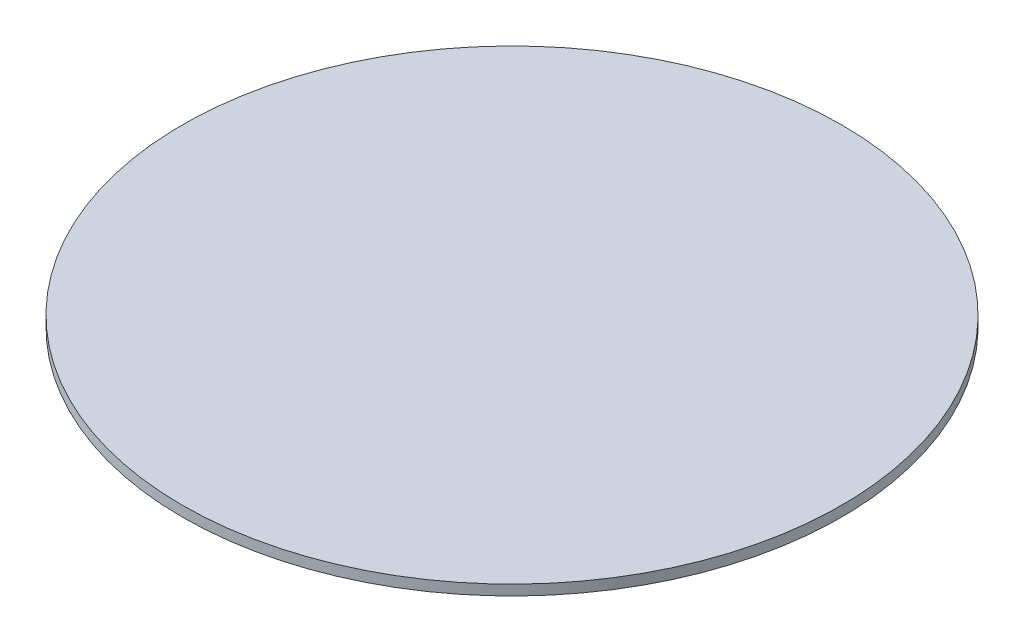
ISO-10303-21;
HEADER;
FILE_DESCRIPTION(('STEP AP214'),'2;1');
FILE_NAME('part.step','',(''),(''),'','','');
FILE_SCHEMA(('AUTOMOTIVE_DESIGN { 1 0 10303 214 1 1 1 1 }'));
ENDSEC;
DATA;
#1=APPLICATION_CONTEXT('core data for automotive mechanical design processes');
#2=APPLICATION_PROTOCOL_DEFINITION('international standard','automotive_design',2000,#1);
#3=PRODUCT_CONTEXT('',#1,'mechanical');
#4=PRODUCT('Part','Part','',(#3));
#5=PRODUCT_RELATED_PRODUCT_CATEGORY('part','',(#4));
#6=PRODUCT_DEFINITION_FORMATION('','',#4);
#7=PRODUCT_DEFINITION_CONTEXT('part definition',#1,'design');
#8=PRODUCT_DEFINITION('design','',#6,#7);
#9=PRODUCT_DEFINITION_SHAPE('','',#8);
#10=(LENGTH_UNIT() NAMED_UNIT(*) SI_UNIT(.MILLI.,.METRE.));
#11=(NAMED_UNIT(*) PLANE_ANGLE_UNIT() SI_UNIT($,.RADIAN.));
#12=(NAMED_UNIT(*) SI_UNIT($,.STERADIAN.) SOLID_ANGLE_UNIT());
#13=UNCERTAINTY_MEASURE_WITH_UNIT(LENGTH_MEASURE(1.E-05),#10,'distance_accuracy_value','');
#14=(GEOMETRIC_REPRESENTATION_CONTEXT(3) GLOBAL_UNCERTAINTY_ASSIGNED_CONTEXT((#13)) GLOBAL_UNIT_ASSIGNED_CONTEXT((#10,
#11,#12)) REPRESENTATION_CONTEXT('',''));
#15=CARTESIAN_POINT('',(0.,0.,0.));
#16=DIRECTION('',(0.,0.,1.));
#17=DIRECTION('',(1.,0.,0.));
#18=AXIS2_PLACEMENT_3D('',#15,#16,#17);
#19=CARTESIAN_POINT('',(0.,0.5,0.));
#20=DIRECTION('',(0.,-1.,0.));
#21=DIRECTION('',(0.,0.,-1.));
#22=AXIS2_PLACEMENT_3D('',#19,#20,#21);
#23=CYLINDRICAL_SURFACE('',#22,16.);
#24=CARTESIAN_POINT('',(0.,0.5,0.));
#25=DIRECTION('',(0.,1.,0.));
#26=DIRECTION('',(0.,0.,1.));
#27=AXIS2_PLACEMENT_3D('',#24,#25,#26);
#28=CIRCLE('',#27,16.);
#29=CARTESIAN_POINT('',(0.,0.5,16.));
#30=VERTEX_POINT('',#29);
#31=EDGE_CURVE('E10',#30,#30,#28,.T.);
#32=ORIENTED_EDGE('',*,*,#31,.F.);
#33=EDGE_LOOP('',(#32));
#34=FACE_BOUND('',#33,.T.);
#35=CARTESIAN_POINT('',(0.,0.,0.));
#36=DIRECTION('',(0.,1.,0.));
#37=DIRECTION('',(0.,0.,1.));
#38=AXIS2_PLACEMENT_3D('',#35,#36,#37);
#39=CIRCLE('',#38,16.);
#40=CARTESIAN_POINT('',(0.,0.,16.));
#41=VERTEX_POINT('',#40);
#42=EDGE_CURVE('E46',#41,#41,#39,.T.);
#43=ORIENTED_EDGE('',*,*,#42,.T.);
#44=EDGE_LOOP('',(#43));
#45=FACE_BOUND('',#44,.T.);
#46=ADVANCED_FACE('F43',(#34,#45),#23,.T.);
#47=CARTESIAN_POINT('',(0.,0.5,0.));
#48=DIRECTION('',(0.,1.,0.));
#49=DIRECTION('',(0.,0.,1.));
#50=AXIS2_PLACEMENT_3D('',#47,#48,#49);
#51=PLANE('',#50);
#52=ORIENTED_EDGE('',*,*,#31,.T.);
#53=EDGE_LOOP('',(#52));
#54=FACE_BOUND('',#53,.T.);
#55=ADVANCED_FACE('F60',(#54),#51,.T.);
#56=CARTESIAN_POINT('',(0.,0.,0.));
#57=DIRECTION('',(0.,1.,0.));
#58=DIRECTION('',(0.,0.,1.));
#59=AXIS2_PLACEMENT_3D('',#56,#57,#58);
#60=PLANE('',#59);
#61=ORIENTED_EDGE('',*,*,#42,.F.);
#62=EDGE_LOOP('',(#61));
#63=FACE_BOUND('',#62,.T.);
#64=ADVANCED_FACE('F58',(#63),#60,.F.);
#65=CLOSED_SHELL('',(#46,#55,#64));
#66=MANIFOLD_SOLID_BREP('B2',#65);
#67=ADVANCED_BREP_SHAPE_REPRESENTATION('',(#18,#66),#14);
#68=SHAPE_DEFINITION_REPRESENTATION(#9,#67);
ENDSEC;
END-ISO-10303-21;
